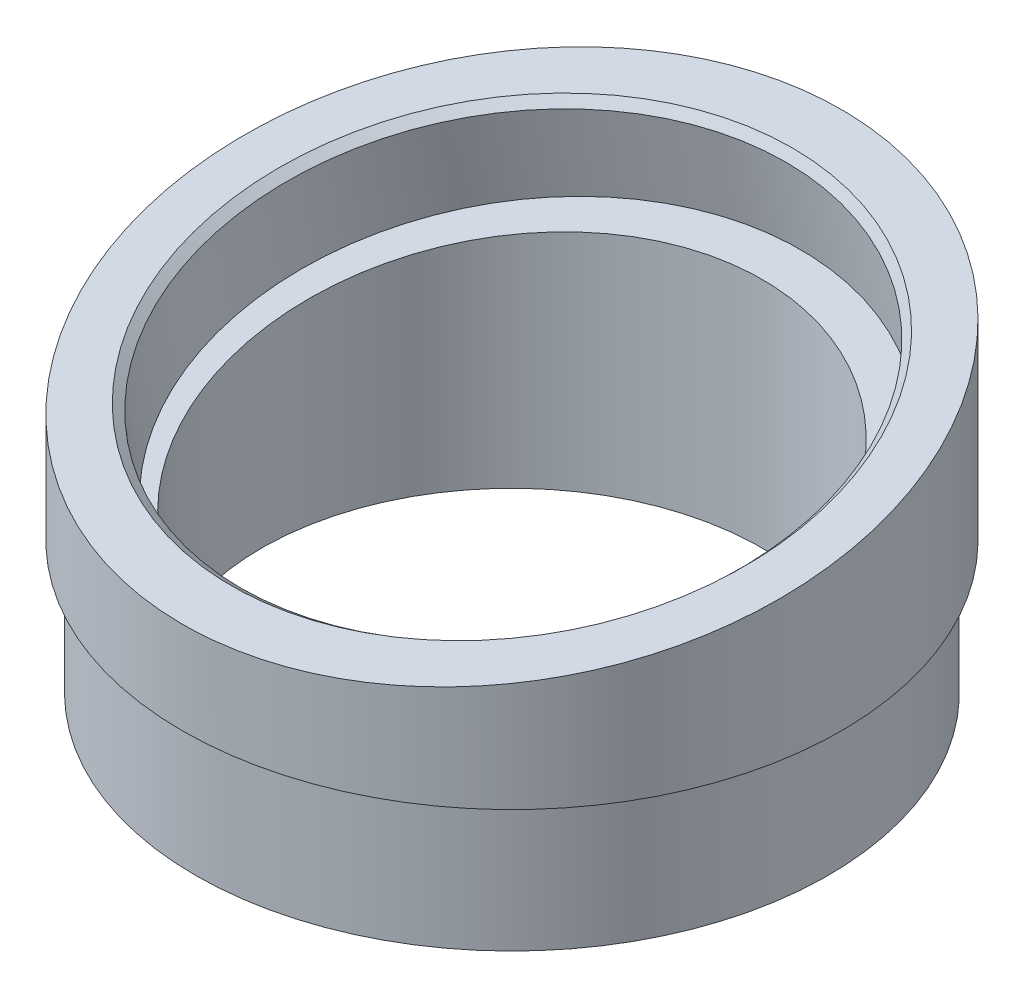
ISO-10303-21;
HEADER;
FILE_DESCRIPTION(('STEP AP214'),'2;1');
FILE_NAME('part.step','',(''),(''),'','','');
FILE_SCHEMA(('AUTOMOTIVE_DESIGN { 1 0 10303 214 1 1 1 1 }'));
ENDSEC;
DATA;
#1=APPLICATION_CONTEXT('core data for automotive mechanical design processes');
#2=APPLICATION_PROTOCOL_DEFINITION('international standard','automotive_design',2000,#1);
#3=PRODUCT_CONTEXT('',#1,'mechanical');
#4=PRODUCT('Part','Part','',(#3));
#5=PRODUCT_RELATED_PRODUCT_CATEGORY('part','',(#4));
#6=PRODUCT_DEFINITION_FORMATION('','',#4);
#7=PRODUCT_DEFINITION_CONTEXT('part definition',#1,'design');
#8=PRODUCT_DEFINITION('design','',#6,#7);
#9=PRODUCT_DEFINITION_SHAPE('','',#8);
#10=(LENGTH_UNIT() NAMED_UNIT(*) SI_UNIT(.MILLI.,.METRE.));
#11=(NAMED_UNIT(*) PLANE_ANGLE_UNIT() SI_UNIT($,.RADIAN.));
#12=(NAMED_UNIT(*) SI_UNIT($,.STERADIAN.) SOLID_ANGLE_UNIT());
#13=UNCERTAINTY_MEASURE_WITH_UNIT(LENGTH_MEASURE(1.E-05),#10,'distance_accuracy_value','');
#14=(GEOMETRIC_REPRESENTATION_CONTEXT(3) GLOBAL_UNCERTAINTY_ASSIGNED_CONTEXT((#13)) GLOBAL_UNIT_ASSIGNED_CONTEXT((#10,
#11,#12)) REPRESENTATION_CONTEXT('',''));
#15=CARTESIAN_POINT('',(0.,0.,0.));
#16=DIRECTION('',(0.,0.,1.));
#17=DIRECTION('',(1.,0.,0.));
#18=AXIS2_PLACEMENT_3D('',#15,#16,#17);
#19=CARTESIAN_POINT('',(0.,10.,0.));
#20=DIRECTION('',(0.,-1.,0.));
#21=DIRECTION('',(0.,0.,-1.));
#22=AXIS2_PLACEMENT_3D('',#19,#20,#21);
#23=CYLINDRICAL_SURFACE('',#22,19.);
#24=CARTESIAN_POINT('',(0.,0.,0.));
#25=DIRECTION('',(0.,1.,0.));
#26=DIRECTION('',(0.,0.,1.));
#27=AXIS2_PLACEMENT_3D('',#24,#25,#26);
#28=CIRCLE('',#27,19.);
#29=CARTESIAN_POINT('',(0.,0.,19.));
#30=VERTEX_POINT('',#29);
#31=EDGE_CURVE('E65',#30,#30,#28,.T.);
#32=ORIENTED_EDGE('',*,*,#31,.F.);
#33=EDGE_LOOP('',(#32));
#34=FACE_BOUND('',#33,.T.);
#35=CARTESIAN_POINT('',(0.,14.3001882345114,0.));
#36=DIRECTION('',(0.,0.984807753012208,0.173648177666931));
#37=DIRECTION('',(0.,-0.173648177666931,0.984807753012208));
#38=AXIS2_PLACEMENT_3D('',#35,#36,#37);
#39=ELLIPSE('',#38,19.2931056258292,19.);
#40=CARTESIAN_POINT('',(0.,10.9499756010506,19.));
#41=VERTEX_POINT('',#40);
#42=EDGE_CURVE('E57',#41,#41,#39,.T.);
#43=ORIENTED_EDGE('',*,*,#42,.T.);
#44=EDGE_LOOP('',(#43));
#45=FACE_BOUND('',#44,.T.);
#46=ADVANCED_FACE('F38',(#34,#45),#23,.F.);
#47=CARTESIAN_POINT('',(0.,0.,0.));
#48=DIRECTION('',(0.,1.,0.));
#49=DIRECTION('',(0.,0.,1.));
#50=AXIS2_PLACEMENT_3D('',#47,#48,#49);
#51=PLANE('',#50);
#52=CARTESIAN_POINT('',(0.,0.,0.));
#53=DIRECTION('',(0.,1.,0.));
#54=DIRECTION('',(0.,0.,1.));
#55=AXIS2_PLACEMENT_3D('',#52,#53,#54);
#56=CIRCLE('',#55,24.);
#57=CARTESIAN_POINT('',(0.,0.,24.));
#58=VERTEX_POINT('',#57);
#59=EDGE_CURVE('E62',#58,#58,#56,.T.);
#60=ORIENTED_EDGE('',*,*,#59,.F.);
#61=EDGE_LOOP('',(#60));
#62=FACE_BOUND('',#61,.T.);
#63=ORIENTED_EDGE('',*,*,#31,.T.);
#64=EDGE_LOOP('',(#63));
#65=FACE_BOUND('',#64,.T.);
#66=ADVANCED_FACE('F90',(#62,#65),#51,.F.);
#67=CARTESIAN_POINT('',(0.,10.,0.));
#68=DIRECTION('',(0.,-1.,0.));
#69=DIRECTION('',(0.,0.,-1.));
#70=AXIS2_PLACEMENT_3D('',#67,#68,#69);
#71=CYLINDRICAL_SURFACE('',#70,24.);
#72=CARTESIAN_POINT('',(0.,10.,0.));
#73=DIRECTION('',(0.,1.,0.));
#74=DIRECTION('',(0.,0.,1.));
#75=AXIS2_PLACEMENT_3D('',#72,#73,#74);
#76=CIRCLE('',#75,24.);
#77=CARTESIAN_POINT('',(0.,10.,24.));
#78=VERTEX_POINT('',#77);
#79=EDGE_CURVE('E54',#78,#78,#76,.T.);
#80=ORIENTED_EDGE('',*,*,#79,.F.);
#81=EDGE_LOOP('',(#80));
#82=FACE_BOUND('',#81,.T.);
#83=ORIENTED_EDGE('',*,*,#59,.T.);
#84=EDGE_LOOP('',(#83));
#85=FACE_BOUND('',#84,.T.);
#86=ADVANCED_FACE('F96',(#82,#85),#71,.T.);
#87=CARTESIAN_POINT('',(0.,10.,0.));
#88=DIRECTION('',(0.,1.,0.));
#89=DIRECTION('',(0.,0.,1.));
#90=AXIS2_PLACEMENT_3D('',#87,#88,#89);
#91=PLANE('',#90);
#92=ORIENTED_EDGE('',*,*,#79,.T.);
#93=EDGE_LOOP('',(#92));
#94=FACE_BOUND('',#93,.T.);
#95=CARTESIAN_POINT('',(0.,10.,0.));
#96=DIRECTION('',(0.,1.,0.));
#97=DIRECTION('',(0.,0.,1.));
#98=AXIS2_PLACEMENT_3D('',#95,#96,#97);
#99=CIRCLE('',#98,25.);
#100=CARTESIAN_POINT('',(0.,10.,25.));
#101=VERTEX_POINT('',#100);
#102=EDGE_CURVE('E59',#101,#101,#99,.T.);
#103=ORIENTED_EDGE('',*,*,#102,.F.);
#104=EDGE_LOOP('',(#103));
#105=FACE_BOUND('',#104,.T.);
#106=ADVANCED_FACE('F104',(#94,#105),#91,.F.);
#107=CARTESIAN_POINT('',(0.,30.,0.));
#108=DIRECTION('',(0.,-1.,0.));
#109=DIRECTION('',(0.,0.,-1.));
#110=AXIS2_PLACEMENT_3D('',#107,#108,#109);
#111=CYLINDRICAL_SURFACE('',#110,25.);
#112=CARTESIAN_POINT('',(0.,21.4081745177116,0.));
#113=DIRECTION('',(0.,-0.984807753012208,-0.173648177666931));
#114=DIRECTION('',(0.,-0.173648177666931,0.984807753012208));
#115=AXIS2_PLACEMENT_3D('',#112,#113,#114);
#116=ELLIPSE('',#115,25.3856652971436,25.);
#117=CARTESIAN_POINT('',(0.,17.,25.));
#118=VERTEX_POINT('',#117);
#119=EDGE_CURVE('E50',#118,#118,#116,.T.);
#120=ORIENTED_EDGE('',*,*,#119,.T.);
#121=EDGE_LOOP('',(#120));
#122=FACE_BOUND('',#121,.T.);
#123=ORIENTED_EDGE('',*,*,#102,.T.);
#124=EDGE_LOOP('',(#123));
#125=FACE_BOUND('',#124,.T.);
#126=ADVANCED_FACE('F87',(#122,#125),#111,.T.);
#127=CARTESIAN_POINT('',(-31.,17.,25.));
#128=DIRECTION('',(0.,-0.984807753012208,-0.173648177666931));
#129=DIRECTION('',(0.,0.173648177666931,-0.984807753012208));
#130=AXIS2_PLACEMENT_3D('',#127,#128,#129);
#131=PLANE('',#130);
#132=CARTESIAN_POINT('',(0.,21.4081745177117,0.));
#133=DIRECTION('',(0.,-0.984807753012208,-0.173648177666931));
#134=DIRECTION('',(0.,0.173648177666931,-0.984807753012208));
#135=AXIS2_PLACEMENT_3D('',#132,#133,#134);
#136=CIRCLE('',#135,21.6);
#137=CARTESIAN_POINT('',(0.,25.1589751553174,-21.2718474650637));
#138=VERTEX_POINT('',#137);
#139=EDGE_CURVE('E10',#138,#138,#136,.T.);
#140=ORIENTED_EDGE('',*,*,#139,.T.);
#141=EDGE_LOOP('',(#140));
#142=FACE_BOUND('',#141,.T.);
#143=ORIENTED_EDGE('',*,*,#119,.F.);
#144=EDGE_LOOP('',(#143));
#145=FACE_BOUND('',#144,.T.);
#146=ADVANCED_FACE('F79',(#142,#145),#131,.F.);
#147=CARTESIAN_POINT('',(0.,14.5145202466262,-1.21553724366852));
#148=DIRECTION('',(0.,0.984807753012208,0.173648177666931));
#149=DIRECTION('',(0.,-0.173648177666931,0.984807753012208));
#150=AXIS2_PLACEMENT_3D('',#147,#148,#149);
#151=CYLINDRICAL_SURFACE('',#150,21.);
#152=CARTESIAN_POINT('',(0.,20.8172898659043,-0.104188906600156));
#153=DIRECTION('',(0.,-0.984807753012208,-0.173648177666931));
#154=DIRECTION('',(0.,0.173648177666931,-0.984807753012208));
#155=AXIS2_PLACEMENT_3D('',#152,#153,#154);
#156=CIRCLE('',#155,21.);
#157=CARTESIAN_POINT('',(0.,24.4639015969099,-20.7851517198565));
#158=VERTEX_POINT('',#157);
#159=EDGE_CURVE('E46',#158,#158,#156,.F.);
#160=ORIENTED_EDGE('',*,*,#159,.T.);
#161=EDGE_LOOP('',(#160));
#162=FACE_BOUND('',#161,.T.);
#163=CARTESIAN_POINT('',(0.,14.5145202466262,-1.21553724366852));
#164=DIRECTION('',(0.,0.984807753012208,0.173648177666931));
#165=DIRECTION('',(0.,-0.173648177666931,0.984807753012208));
#166=AXIS2_PLACEMENT_3D('',#163,#164,#165);
#167=CIRCLE('',#166,21.);
#168=CARTESIAN_POINT('',(0.,10.8679085156206,19.4654255695878));
#169=VERTEX_POINT('',#168);
#170=EDGE_CURVE('E60',#169,#169,#167,.T.);
#171=ORIENTED_EDGE('',*,*,#170,.F.);
#172=EDGE_LOOP('',(#171));
#173=FACE_BOUND('',#172,.T.);
#174=ADVANCED_FACE('F77',(#162,#173),#151,.F.);
#175=CARTESIAN_POINT('',(0.,14.5145202466262,-1.21553724366852));
#176=DIRECTION('',(0.,0.984807753012208,0.173648177666931));
#177=DIRECTION('',(0.,-0.173648177666931,0.984807753012208));
#178=AXIS2_PLACEMENT_3D('',#175,#176,#177);
#179=PLANE('',#178);
#180=ORIENTED_EDGE('',*,*,#42,.F.);
#181=EDGE_LOOP('',(#180));
#182=FACE_BOUND('',#181,.T.);
#183=ORIENTED_EDGE('',*,*,#170,.T.);
#184=EDGE_LOOP('',(#183));
#185=FACE_BOUND('',#184,.T.);
#186=ADVANCED_FACE('F75',(#182,#185),#179,.T.);
#187=CARTESIAN_POINT('',(0.,20.8172898659043,-0.104188906600156));
#188=DIRECTION('',(0.,0.984807753012208,0.173648177666931));
#189=DIRECTION('',(0.,-0.173648177666931,0.984807753012208));
#190=AXIS2_PLACEMENT_3D('',#187,#188,#189);
#191=CONICAL_SURFACE('',#190,21.,0.785398163397441);
#192=ORIENTED_EDGE('',*,*,#139,.F.);
#193=EDGE_LOOP('',(#192));
#194=FACE_BOUND('',#193,.T.);
#195=ORIENTED_EDGE('',*,*,#159,.F.);
#196=EDGE_LOOP('',(#195));
#197=FACE_BOUND('',#196,.T.);
#198=ADVANCED_FACE('F41',(#194,#197),#191,.F.);
#199=CLOSED_SHELL('',(#46,#66,#86,#106,#126,#146,#174,#186,#198));
#200=MANIFOLD_SOLID_BREP('B2',#199);
#201=ADVANCED_BREP_SHAPE_REPRESENTATION('',(#18,#200),#14);
#202=SHAPE_DEFINITION_REPRESENTATION(#9,#201);
ENDSEC;
END-ISO-10303-21;
